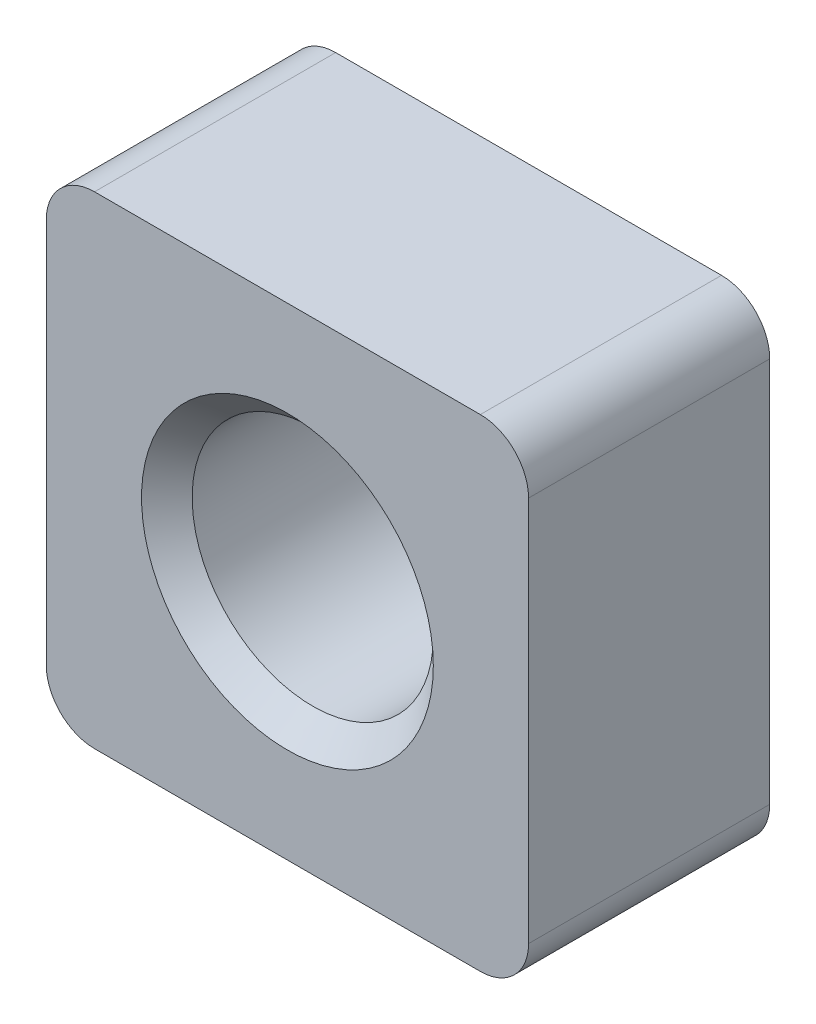
ISO-10303-21;
HEADER;
FILE_DESCRIPTION(('STEP AP214'),'2;1');
FILE_NAME('part.step','',(''),(''),'','','');
FILE_SCHEMA(('AUTOMOTIVE_DESIGN { 1 0 10303 214 1 1 1 1 }'));
ENDSEC;
DATA;
#1=APPLICATION_CONTEXT('core data for automotive mechanical design processes');
#2=APPLICATION_PROTOCOL_DEFINITION('international standard','automotive_design',2000,#1);
#3=PRODUCT_CONTEXT('',#1,'mechanical');
#4=PRODUCT('Part','Part','',(#3));
#5=PRODUCT_RELATED_PRODUCT_CATEGORY('part','',(#4));
#6=PRODUCT_DEFINITION_FORMATION('','',#4);
#7=PRODUCT_DEFINITION_CONTEXT('part definition',#1,'design');
#8=PRODUCT_DEFINITION('design','',#6,#7);
#9=PRODUCT_DEFINITION_SHAPE('','',#8);
#10=(LENGTH_UNIT() NAMED_UNIT(*) SI_UNIT(.MILLI.,.METRE.));
#11=(NAMED_UNIT(*) PLANE_ANGLE_UNIT() SI_UNIT($,.RADIAN.));
#12=(NAMED_UNIT(*) SI_UNIT($,.STERADIAN.) SOLID_ANGLE_UNIT());
#13=UNCERTAINTY_MEASURE_WITH_UNIT(LENGTH_MEASURE(1.E-05),#10,'distance_accuracy_value','');
#14=(GEOMETRIC_REPRESENTATION_CONTEXT(3) GLOBAL_UNCERTAINTY_ASSIGNED_CONTEXT((#13)) GLOBAL_UNIT_ASSIGNED_CONTEXT((#10,
#11,#12)) REPRESENTATION_CONTEXT('',''));
#15=CARTESIAN_POINT('',(0.,0.,0.));
#16=DIRECTION('',(0.,0.,1.));
#17=DIRECTION('',(1.,0.,0.));
#18=AXIS2_PLACEMENT_3D('',#15,#16,#17);
#19=CARTESIAN_POINT('',(5.,-5.,5.));
#20=DIRECTION('',(-1.,0.,0.));
#21=DIRECTION('',(0.,0.,1.));
#22=AXIS2_PLACEMENT_3D('',#19,#20,#21);
#23=PLANE('',#22);
#24=DIRECTION('',(0.,1.,0.));
#25=VECTOR('',#24,1.);
#26=CARTESIAN_POINT('',(5.,-5.,0.));
#27=LINE('',#26,#25);
#28=CARTESIAN_POINT('',(5.,-4.,0.));
#29=VERTEX_POINT('',#28);
#30=CARTESIAN_POINT('',(5.,4.,0.));
#31=VERTEX_POINT('',#30);
#32=EDGE_CURVE('E129',#29,#31,#27,.T.);
#33=ORIENTED_EDGE('',*,*,#32,.T.);
#34=DIRECTION('',(0.,0.,-1.));
#35=VECTOR('',#34,1.);
#36=CARTESIAN_POINT('',(5.,4.,5.));
#37=LINE('',#36,#35);
#38=CARTESIAN_POINT('',(5.,4.,5.));
#39=VERTEX_POINT('',#38);
#40=EDGE_CURVE('E107',#31,#39,#37,.F.);
#41=ORIENTED_EDGE('',*,*,#40,.T.);
#42=DIRECTION('',(0.,1.,0.));
#43=VECTOR('',#42,1.);
#44=CARTESIAN_POINT('',(5.,-5.,5.));
#45=LINE('',#44,#43);
#46=CARTESIAN_POINT('',(5.,-4.,5.));
#47=VERTEX_POINT('',#46);
#48=EDGE_CURVE('E139',#47,#39,#45,.T.);
#49=ORIENTED_EDGE('',*,*,#48,.F.);
#50=DIRECTION('',(0.,0.,-1.));
#51=VECTOR('',#50,1.);
#52=CARTESIAN_POINT('',(5.,-4.,5.));
#53=LINE('',#52,#51);
#54=EDGE_CURVE('E112',#47,#29,#53,.T.);
#55=ORIENTED_EDGE('',*,*,#54,.T.);
#56=EDGE_LOOP('',(#33,#41,#49,#55));
#57=FACE_BOUND('',#56,.T.);
#58=ADVANCED_FACE('F37',(#57),#23,.F.);
#59=CARTESIAN_POINT('',(-5.,5.,5.));
#60=DIRECTION('',(0.,-1.,0.));
#61=DIRECTION('',(0.,0.,-1.));
#62=AXIS2_PLACEMENT_3D('',#59,#60,#61);
#63=PLANE('',#62);
#64=DIRECTION('',(-1.,0.,0.));
#65=VECTOR('',#64,1.);
#66=CARTESIAN_POINT('',(-5.,5.,5.));
#67=LINE('',#66,#65);
#68=CARTESIAN_POINT('',(4.,5.,5.));
#69=VERTEX_POINT('',#68);
#70=CARTESIAN_POINT('',(-4.,5.,5.));
#71=VERTEX_POINT('',#70);
#72=EDGE_CURVE('E122',#69,#71,#67,.T.);
#73=ORIENTED_EDGE('',*,*,#72,.F.);
#74=DIRECTION('',(0.,0.,-1.));
#75=VECTOR('',#74,1.);
#76=CARTESIAN_POINT('',(4.,5.,5.));
#77=LINE('',#76,#75);
#78=CARTESIAN_POINT('',(4.,5.,0.));
#79=VERTEX_POINT('',#78);
#80=EDGE_CURVE('E106',#69,#79,#77,.T.);
#81=ORIENTED_EDGE('',*,*,#80,.T.);
#82=DIRECTION('',(-1.,0.,0.));
#83=VECTOR('',#82,1.);
#84=CARTESIAN_POINT('',(-5.,5.,0.));
#85=LINE('',#84,#83);
#86=CARTESIAN_POINT('',(-4.,5.,0.));
#87=VERTEX_POINT('',#86);
#88=EDGE_CURVE('E119',#79,#87,#85,.T.);
#89=ORIENTED_EDGE('',*,*,#88,.T.);
#90=DIRECTION('',(0.,0.,-1.));
#91=VECTOR('',#90,1.);
#92=CARTESIAN_POINT('',(-4.,5.,5.));
#93=LINE('',#92,#91);
#94=EDGE_CURVE('E124',#87,#71,#93,.F.);
#95=ORIENTED_EDGE('',*,*,#94,.T.);
#96=EDGE_LOOP('',(#73,#81,#89,#95));
#97=FACE_BOUND('',#96,.T.);
#98=ADVANCED_FACE('F118',(#97),#63,.F.);
#99=CARTESIAN_POINT('',(-5.,-5.,5.));
#100=DIRECTION('',(1.,0.,0.));
#101=DIRECTION('',(0.,0.,-1.));
#102=AXIS2_PLACEMENT_3D('',#99,#100,#101);
#103=PLANE('',#102);
#104=DIRECTION('',(0.,-1.,0.));
#105=VECTOR('',#104,1.);
#106=CARTESIAN_POINT('',(-5.,-5.,5.));
#107=LINE('',#106,#105);
#108=CARTESIAN_POINT('',(-5.,4.,5.));
#109=VERTEX_POINT('',#108);
#110=CARTESIAN_POINT('',(-5.,-4.,5.));
#111=VERTEX_POINT('',#110);
#112=EDGE_CURVE('E173',#109,#111,#107,.T.);
#113=ORIENTED_EDGE('',*,*,#112,.F.);
#114=DIRECTION('',(0.,0.,-1.));
#115=VECTOR('',#114,1.);
#116=CARTESIAN_POINT('',(-5.,4.,5.));
#117=LINE('',#116,#115);
#118=CARTESIAN_POINT('',(-5.,4.,0.));
#119=VERTEX_POINT('',#118);
#120=EDGE_CURVE('E158',#109,#119,#117,.T.);
#121=ORIENTED_EDGE('',*,*,#120,.T.);
#122=DIRECTION('',(0.,-1.,0.));
#123=VECTOR('',#122,1.);
#124=CARTESIAN_POINT('',(-5.,-5.,0.));
#125=LINE('',#124,#123);
#126=CARTESIAN_POINT('',(-5.,-4.,0.));
#127=VERTEX_POINT('',#126);
#128=EDGE_CURVE('E128',#119,#127,#125,.T.);
#129=ORIENTED_EDGE('',*,*,#128,.T.);
#130=DIRECTION('',(0.,0.,-1.));
#131=VECTOR('',#130,1.);
#132=CARTESIAN_POINT('',(-5.,-4.,5.));
#133=LINE('',#132,#131);
#134=EDGE_CURVE('E156',#127,#111,#133,.F.);
#135=ORIENTED_EDGE('',*,*,#134,.T.);
#136=EDGE_LOOP('',(#113,#121,#129,#135));
#137=FACE_BOUND('',#136,.T.);
#138=ADVANCED_FACE('F189',(#137),#103,.F.);
#139=CARTESIAN_POINT('',(-5.,-5.,5.));
#140=DIRECTION('',(0.,1.,0.));
#141=DIRECTION('',(0.,0.,1.));
#142=AXIS2_PLACEMENT_3D('',#139,#140,#141);
#143=PLANE('',#142);
#144=DIRECTION('',(1.,0.,0.));
#145=VECTOR('',#144,1.);
#146=CARTESIAN_POINT('',(-5.,-5.,0.));
#147=LINE('',#146,#145);
#148=CARTESIAN_POINT('',(-4.,-5.,0.));
#149=VERTEX_POINT('',#148);
#150=CARTESIAN_POINT('',(4.,-5.,0.));
#151=VERTEX_POINT('',#150);
#152=EDGE_CURVE('E132',#149,#151,#147,.T.);
#153=ORIENTED_EDGE('',*,*,#152,.T.);
#154=DIRECTION('',(0.,0.,-1.));
#155=VECTOR('',#154,1.);
#156=CARTESIAN_POINT('',(4.,-5.,5.));
#157=LINE('',#156,#155);
#158=CARTESIAN_POINT('',(4.,-5.,5.));
#159=VERTEX_POINT('',#158);
#160=EDGE_CURVE('E11',#151,#159,#157,.F.);
#161=ORIENTED_EDGE('',*,*,#160,.T.);
#162=DIRECTION('',(1.,0.,0.));
#163=VECTOR('',#162,1.);
#164=CARTESIAN_POINT('',(-5.,-5.,5.));
#165=LINE('',#164,#163);
#166=CARTESIAN_POINT('',(-4.,-5.,5.));
#167=VERTEX_POINT('',#166);
#168=EDGE_CURVE('E140',#167,#159,#165,.T.);
#169=ORIENTED_EDGE('',*,*,#168,.F.);
#170=DIRECTION('',(0.,0.,-1.));
#171=VECTOR('',#170,1.);
#172=CARTESIAN_POINT('',(-4.,-5.,5.));
#173=LINE('',#172,#171);
#174=EDGE_CURVE('E45',#167,#149,#173,.T.);
#175=ORIENTED_EDGE('',*,*,#174,.T.);
#176=EDGE_LOOP('',(#153,#161,#169,#175));
#177=FACE_BOUND('',#176,.T.);
#178=ADVANCED_FACE('F163',(#177),#143,.F.);
#179=CARTESIAN_POINT('',(0.,0.,5.));
#180=DIRECTION('',(0.,0.,-1.));
#181=DIRECTION('',(-1.,0.,0.));
#182=AXIS2_PLACEMENT_3D('',#179,#180,#181);
#183=PLANE('',#182);
#184=CARTESIAN_POINT('',(0.,0.,5.));
#185=DIRECTION('',(0.,0.,1.));
#186=DIRECTION('',(1.,0.,0.));
#187=AXIS2_PLACEMENT_3D('',#184,#185,#186);
#188=CIRCLE('',#187,3.025);
#189=CARTESIAN_POINT('',(3.025,0.,5.));
#190=VERTEX_POINT('',#189);
#191=EDGE_CURVE('E298',#190,#190,#188,.T.);
#192=ORIENTED_EDGE('',*,*,#191,.F.);
#193=EDGE_LOOP('',(#192));
#194=FACE_BOUND('',#193,.T.);
#195=ORIENTED_EDGE('',*,*,#48,.T.);
#196=CARTESIAN_POINT('',(4.,4.,5.));
#197=DIRECTION('',(0.,0.,-1.));
#198=DIRECTION('',(-1.,0.,0.));
#199=AXIS2_PLACEMENT_3D('',#196,#197,#198);
#200=CIRCLE('',#199,1.);
#201=EDGE_CURVE('E154',#39,#69,#200,.F.);
#202=ORIENTED_EDGE('',*,*,#201,.T.);
#203=ORIENTED_EDGE('',*,*,#72,.T.);
#204=CARTESIAN_POINT('',(-4.,4.,5.));
#205=DIRECTION('',(0.,0.,-1.));
#206=DIRECTION('',(-1.,0.,0.));
#207=AXIS2_PLACEMENT_3D('',#204,#205,#206);
#208=CIRCLE('',#207,1.);
#209=EDGE_CURVE('E152',#71,#109,#208,.F.);
#210=ORIENTED_EDGE('',*,*,#209,.T.);
#211=ORIENTED_EDGE('',*,*,#112,.T.);
#212=CARTESIAN_POINT('',(-4.,-4.,5.));
#213=DIRECTION('',(0.,0.,-1.));
#214=DIRECTION('',(-1.,0.,0.));
#215=AXIS2_PLACEMENT_3D('',#212,#213,#214);
#216=CIRCLE('',#215,1.);
#217=EDGE_CURVE('E57',#111,#167,#216,.F.);
#218=ORIENTED_EDGE('',*,*,#217,.T.);
#219=ORIENTED_EDGE('',*,*,#168,.T.);
#220=CARTESIAN_POINT('',(4.,-4.,5.));
#221=DIRECTION('',(0.,0.,-1.));
#222=DIRECTION('',(-1.,0.,0.));
#223=AXIS2_PLACEMENT_3D('',#220,#221,#222);
#224=CIRCLE('',#223,1.);
#225=EDGE_CURVE('E150',#159,#47,#224,.F.);
#226=ORIENTED_EDGE('',*,*,#225,.T.);
#227=EDGE_LOOP('',(#195,#202,#203,#210,#211,#218,#219,#226));
#228=FACE_BOUND('',#227,.T.);
#229=ADVANCED_FACE('F178',(#194,#228),#183,.F.);
#230=CARTESIAN_POINT('',(0.,0.,0.));
#231=DIRECTION('',(0.,0.,-1.));
#232=DIRECTION('',(-1.,0.,0.));
#233=AXIS2_PLACEMENT_3D('',#230,#231,#232);
#234=PLANE('',#233);
#235=CARTESIAN_POINT('',(0.,0.,0.));
#236=DIRECTION('',(0.,0.,1.));
#237=DIRECTION('',(1.,0.,0.));
#238=AXIS2_PLACEMENT_3D('',#235,#236,#237);
#239=CIRCLE('',#238,3.025);
#240=CARTESIAN_POINT('',(3.025,0.,0.));
#241=VERTEX_POINT('',#240);
#242=EDGE_CURVE('E293',#241,#241,#239,.T.);
#243=ORIENTED_EDGE('',*,*,#242,.T.);
#244=EDGE_LOOP('',(#243));
#245=FACE_BOUND('',#244,.T.);
#246=ORIENTED_EDGE('',*,*,#88,.F.);
#247=CARTESIAN_POINT('',(4.,4.,0.));
#248=DIRECTION('',(0.,0.,-1.));
#249=DIRECTION('',(-1.,0.,0.));
#250=AXIS2_PLACEMENT_3D('',#247,#248,#249);
#251=CIRCLE('',#250,1.);
#252=EDGE_CURVE('E102',#79,#31,#251,.T.);
#253=ORIENTED_EDGE('',*,*,#252,.T.);
#254=ORIENTED_EDGE('',*,*,#32,.F.);
#255=CARTESIAN_POINT('',(4.,-4.,0.));
#256=DIRECTION('',(0.,0.,-1.));
#257=DIRECTION('',(-1.,0.,0.));
#258=AXIS2_PLACEMENT_3D('',#255,#256,#257);
#259=CIRCLE('',#258,1.);
#260=EDGE_CURVE('E143',#29,#151,#259,.T.);
#261=ORIENTED_EDGE('',*,*,#260,.T.);
#262=ORIENTED_EDGE('',*,*,#152,.F.);
#263=CARTESIAN_POINT('',(-4.,-4.,0.));
#264=DIRECTION('',(0.,0.,-1.));
#265=DIRECTION('',(-1.,0.,0.));
#266=AXIS2_PLACEMENT_3D('',#263,#264,#265);
#267=CIRCLE('',#266,1.);
#268=EDGE_CURVE('E123',#149,#127,#267,.T.);
#269=ORIENTED_EDGE('',*,*,#268,.T.);
#270=ORIENTED_EDGE('',*,*,#128,.F.);
#271=CARTESIAN_POINT('',(-4.,4.,0.));
#272=DIRECTION('',(0.,0.,-1.));
#273=DIRECTION('',(-1.,0.,0.));
#274=AXIS2_PLACEMENT_3D('',#271,#272,#273);
#275=CIRCLE('',#274,1.);
#276=EDGE_CURVE('E113',#119,#87,#275,.T.);
#277=ORIENTED_EDGE('',*,*,#276,.T.);
#278=EDGE_LOOP('',(#246,#253,#254,#261,#262,#269,#270,#277));
#279=FACE_BOUND('',#278,.T.);
#280=ADVANCED_FACE('F126',(#245,#279),#234,.T.);
#281=CARTESIAN_POINT('',(0.,0.,0.525000000000003));
#282=DIRECTION('',(0.,0.,-1.));
#283=DIRECTION('',(-1.,0.,0.));
#284=AXIS2_PLACEMENT_3D('',#281,#282,#283);
#285=CONICAL_SURFACE('',#284,2.5,0.785398163397445);
#286=ORIENTED_EDGE('',*,*,#242,.F.);
#287=EDGE_LOOP('',(#286));
#288=FACE_BOUND('',#287,.T.);
#289=CARTESIAN_POINT('',(0.,0.,0.525000000000003));
#290=DIRECTION('',(0.,0.,1.));
#291=DIRECTION('',(1.,0.,0.));
#292=AXIS2_PLACEMENT_3D('',#289,#290,#291);
#293=CIRCLE('',#292,2.5);
#294=CARTESIAN_POINT('',(2.5,0.,0.525000000000003));
#295=VERTEX_POINT('',#294);
#296=EDGE_CURVE('E134',#295,#295,#293,.T.);
#297=ORIENTED_EDGE('',*,*,#296,.T.);
#298=EDGE_LOOP('',(#297));
#299=FACE_BOUND('',#298,.T.);
#300=ADVANCED_FACE('F186',(#288,#299),#285,.F.);
#301=CARTESIAN_POINT('',(0.,0.,5.));
#302=DIRECTION('',(0.,0.,1.));
#303=DIRECTION('',(1.,0.,0.));
#304=AXIS2_PLACEMENT_3D('',#301,#302,#303);
#305=CYLINDRICAL_SURFACE('',#304,2.5);
#306=ORIENTED_EDGE('',*,*,#296,.F.);
#307=EDGE_LOOP('',(#306));
#308=FACE_BOUND('',#307,.T.);
#309=CARTESIAN_POINT('',(0.,0.,4.475));
#310=DIRECTION('',(0.,0.,1.));
#311=DIRECTION('',(1.,0.,0.));
#312=AXIS2_PLACEMENT_3D('',#309,#310,#311);
#313=CIRCLE('',#312,2.5);
#314=CARTESIAN_POINT('',(2.5,0.,4.475));
#315=VERTEX_POINT('',#314);
#316=EDGE_CURVE('E296',#315,#315,#313,.T.);
#317=ORIENTED_EDGE('',*,*,#316,.T.);
#318=EDGE_LOOP('',(#317));
#319=FACE_BOUND('',#318,.T.);
#320=ADVANCED_FACE('F268',(#308,#319),#305,.F.);
#321=CARTESIAN_POINT('',(0.,0.,5.));
#322=DIRECTION('',(0.,0.,1.));
#323=DIRECTION('',(1.,0.,0.));
#324=AXIS2_PLACEMENT_3D('',#321,#322,#323);
#325=CONICAL_SURFACE('',#324,3.025,0.785398163397449);
#326=ORIENTED_EDGE('',*,*,#316,.F.);
#327=EDGE_LOOP('',(#326));
#328=FACE_BOUND('',#327,.T.);
#329=ORIENTED_EDGE('',*,*,#191,.T.);
#330=EDGE_LOOP('',(#329));
#331=FACE_BOUND('',#330,.T.);
#332=ADVANCED_FACE('F204',(#328,#331),#325,.F.);
#333=CARTESIAN_POINT('',(4.,4.,5.));
#334=DIRECTION('',(0.,0.,-1.));
#335=DIRECTION('',(-1.,0.,0.));
#336=AXIS2_PLACEMENT_3D('',#333,#334,#335);
#337=CYLINDRICAL_SURFACE('',#336,1.);
#338=ORIENTED_EDGE('',*,*,#201,.F.);
#339=ORIENTED_EDGE('',*,*,#40,.F.);
#340=ORIENTED_EDGE('',*,*,#252,.F.);
#341=ORIENTED_EDGE('',*,*,#80,.F.);
#342=EDGE_LOOP('',(#338,#339,#340,#341));
#343=FACE_BOUND('',#342,.T.);
#344=ADVANCED_FACE('F105',(#343),#337,.T.);
#345=CARTESIAN_POINT('',(-4.,4.,5.));
#346=DIRECTION('',(0.,0.,-1.));
#347=DIRECTION('',(-1.,0.,0.));
#348=AXIS2_PLACEMENT_3D('',#345,#346,#347);
#349=CYLINDRICAL_SURFACE('',#348,1.);
#350=ORIENTED_EDGE('',*,*,#209,.F.);
#351=ORIENTED_EDGE('',*,*,#94,.F.);
#352=ORIENTED_EDGE('',*,*,#276,.F.);
#353=ORIENTED_EDGE('',*,*,#120,.F.);
#354=EDGE_LOOP('',(#350,#351,#352,#353));
#355=FACE_BOUND('',#354,.T.);
#356=ADVANCED_FACE('F203',(#355),#349,.T.);
#357=CARTESIAN_POINT('',(4.,-4.,5.));
#358=DIRECTION('',(0.,0.,-1.));
#359=DIRECTION('',(-1.,0.,0.));
#360=AXIS2_PLACEMENT_3D('',#357,#358,#359);
#361=CYLINDRICAL_SURFACE('',#360,1.);
#362=ORIENTED_EDGE('',*,*,#225,.F.);
#363=ORIENTED_EDGE('',*,*,#160,.F.);
#364=ORIENTED_EDGE('',*,*,#260,.F.);
#365=ORIENTED_EDGE('',*,*,#54,.F.);
#366=EDGE_LOOP('',(#362,#363,#364,#365));
#367=FACE_BOUND('',#366,.T.);
#368=ADVANCED_FACE('F168',(#367),#361,.T.);
#369=CARTESIAN_POINT('',(-4.,-4.,5.));
#370=DIRECTION('',(0.,0.,-1.));
#371=DIRECTION('',(-1.,0.,0.));
#372=AXIS2_PLACEMENT_3D('',#369,#370,#371);
#373=CYLINDRICAL_SURFACE('',#372,1.);
#374=ORIENTED_EDGE('',*,*,#217,.F.);
#375=ORIENTED_EDGE('',*,*,#134,.F.);
#376=ORIENTED_EDGE('',*,*,#268,.F.);
#377=ORIENTED_EDGE('',*,*,#174,.F.);
#378=EDGE_LOOP('',(#374,#375,#376,#377));
#379=FACE_BOUND('',#378,.T.);
#380=ADVANCED_FACE('F39',(#379),#373,.T.);
#381=CLOSED_SHELL('',(#58,#98,#138,#178,#229,#280,#300,#320,#332,#344,#356,#368,#380));
#382=MANIFOLD_SOLID_BREP('B2',#381);
#383=ADVANCED_BREP_SHAPE_REPRESENTATION('',(#18,#382),#14);
#384=SHAPE_DEFINITION_REPRESENTATION(#9,#383);
ENDSEC;
END-ISO-10303-21;
